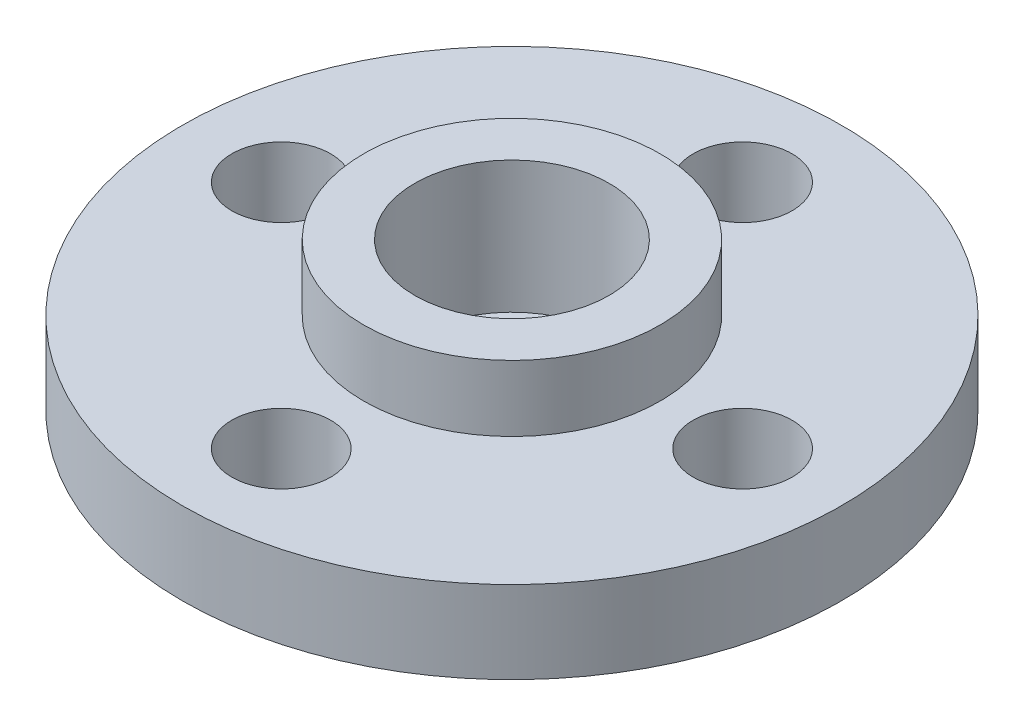
ISO-10303-21;
HEADER;
FILE_DESCRIPTION(('STEP AP214'),'2;1');
FILE_NAME('part.step','',(''),(''),'','','');
FILE_SCHEMA(('AUTOMOTIVE_DESIGN { 1 0 10303 214 1 1 1 1 }'));
ENDSEC;
DATA;
#1=APPLICATION_CONTEXT('core data for automotive mechanical design processes');
#2=APPLICATION_PROTOCOL_DEFINITION('international standard','automotive_design',2000,#1);
#3=PRODUCT_CONTEXT('',#1,'mechanical');
#4=PRODUCT('Part','Part','',(#3));
#5=PRODUCT_RELATED_PRODUCT_CATEGORY('part','',(#4));
#6=PRODUCT_DEFINITION_FORMATION('','',#4);
#7=PRODUCT_DEFINITION_CONTEXT('part definition',#1,'design');
#8=PRODUCT_DEFINITION('design','',#6,#7);
#9=PRODUCT_DEFINITION_SHAPE('','',#8);
#10=(LENGTH_UNIT() NAMED_UNIT(*) SI_UNIT(.MILLI.,.METRE.));
#11=(NAMED_UNIT(*) PLANE_ANGLE_UNIT() SI_UNIT($,.RADIAN.));
#12=(NAMED_UNIT(*) SI_UNIT($,.STERADIAN.) SOLID_ANGLE_UNIT());
#13=UNCERTAINTY_MEASURE_WITH_UNIT(LENGTH_MEASURE(1.E-05),#10,'distance_accuracy_value','');
#14=(GEOMETRIC_REPRESENTATION_CONTEXT(3) GLOBAL_UNCERTAINTY_ASSIGNED_CONTEXT((#13)) GLOBAL_UNIT_ASSIGNED_CONTEXT((#10,
#11,#12)) REPRESENTATION_CONTEXT('',''));
#15=CARTESIAN_POINT('',(0.,0.,0.));
#16=DIRECTION('',(0.,0.,1.));
#17=DIRECTION('',(1.,0.,0.));
#18=AXIS2_PLACEMENT_3D('',#15,#16,#17);
#19=CARTESIAN_POINT('',(0.,0.,0.));
#20=DIRECTION('',(0.,1.,0.));
#21=DIRECTION('',(0.,0.,1.));
#22=AXIS2_PLACEMENT_3D('',#19,#20,#21);
#23=CYLINDRICAL_SURFACE('',#22,1.6);
#24=CARTESIAN_POINT('',(0.,0.,0.));
#25=DIRECTION('',(0.,1.,0.));
#26=DIRECTION('',(0.,0.,1.));
#27=AXIS2_PLACEMENT_3D('',#24,#25,#26);
#28=CIRCLE('',#27,1.6);
#29=CARTESIAN_POINT('',(0.,0.,1.6));
#30=VERTEX_POINT('',#29);
#31=EDGE_CURVE('E86',#30,#30,#28,.T.);
#32=ORIENTED_EDGE('',*,*,#31,.F.);
#33=EDGE_LOOP('',(#32));
#34=FACE_BOUND('',#33,.T.);
#35=CARTESIAN_POINT('',(0.,0.5,0.));
#36=DIRECTION('',(0.,1.,0.));
#37=DIRECTION('',(0.,0.,1.));
#38=AXIS2_PLACEMENT_3D('',#35,#36,#37);
#39=CIRCLE('',#38,1.6);
#40=CARTESIAN_POINT('',(0.,0.5,1.6));
#41=VERTEX_POINT('',#40);
#42=EDGE_CURVE('E92',#41,#41,#39,.T.);
#43=ORIENTED_EDGE('',*,*,#42,.T.);
#44=EDGE_LOOP('',(#43));
#45=FACE_BOUND('',#44,.T.);
#46=ADVANCED_FACE('F41',(#34,#45),#23,.F.);
#47=CARTESIAN_POINT('',(0.,2.5,0.));
#48=DIRECTION('',(0.,1.,0.));
#49=DIRECTION('',(0.,0.,1.));
#50=AXIS2_PLACEMENT_3D('',#47,#48,#49);
#51=PLANE('',#50);
#52=CARTESIAN_POINT('',(0.,2.5,0.));
#53=DIRECTION('',(0.,1.,0.));
#54=DIRECTION('',(0.,0.,1.));
#55=AXIS2_PLACEMENT_3D('',#52,#53,#54);
#56=CIRCLE('',#55,4.5);
#57=CARTESIAN_POINT('',(0.,2.5,4.5));
#58=VERTEX_POINT('',#57);
#59=EDGE_CURVE('E78',#58,#58,#56,.T.);
#60=ORIENTED_EDGE('',*,*,#59,.F.);
#61=EDGE_LOOP('',(#60));
#62=FACE_BOUND('',#61,.T.);
#63=CARTESIAN_POINT('',(1.96380207734619E-13,2.5,7.));
#64=DIRECTION('',(0.,1.,0.));
#65=DIRECTION('',(0.,0.,1.));
#66=AXIS2_PLACEMENT_3D('',#63,#64,#65);
#67=CIRCLE('',#66,1.50000000000023);
#68=CARTESIAN_POINT('',(1.96380207734619E-13,2.5,8.50000000000023));
#69=VERTEX_POINT('',#68);
#70=EDGE_CURVE('E63',#69,#69,#67,.T.);
#71=ORIENTED_EDGE('',*,*,#70,.F.);
#72=EDGE_LOOP('',(#71));
#73=FACE_BOUND('',#72,.T.);
#74=CARTESIAN_POINT('',(0.,2.5,-7.));
#75=DIRECTION('',(0.,1.,0.));
#76=DIRECTION('',(0.,0.,1.));
#77=AXIS2_PLACEMENT_3D('',#74,#75,#76);
#78=CIRCLE('',#77,1.5);
#79=CARTESIAN_POINT('',(0.,2.5,-5.5));
#80=VERTEX_POINT('',#79);
#81=EDGE_CURVE('E52',#80,#80,#78,.T.);
#82=ORIENTED_EDGE('',*,*,#81,.F.);
#83=EDGE_LOOP('',(#82));
#84=FACE_BOUND('',#83,.T.);
#85=CARTESIAN_POINT('',(0.,2.5,0.));
#86=DIRECTION('',(0.,1.,0.));
#87=DIRECTION('',(0.,0.,1.));
#88=AXIS2_PLACEMENT_3D('',#85,#86,#87);
#89=CIRCLE('',#88,10.);
#90=CARTESIAN_POINT('',(0.,2.5,10.));
#91=VERTEX_POINT('',#90);
#92=EDGE_CURVE('E10',#91,#91,#89,.T.);
#93=ORIENTED_EDGE('',*,*,#92,.T.);
#94=EDGE_LOOP('',(#93));
#95=FACE_BOUND('',#94,.T.);
#96=CARTESIAN_POINT('',(7.,2.5,0.));
#97=DIRECTION('',(0.,1.,0.));
#98=DIRECTION('',(0.,0.,1.));
#99=AXIS2_PLACEMENT_3D('',#96,#97,#98);
#100=CIRCLE('',#99,1.5);
#101=CARTESIAN_POINT('',(7.,2.5,1.50000000000002));
#102=VERTEX_POINT('',#101);
#103=EDGE_CURVE('E57',#102,#102,#100,.T.);
#104=ORIENTED_EDGE('',*,*,#103,.F.);
#105=EDGE_LOOP('',(#104));
#106=FACE_BOUND('',#105,.T.);
#107=CARTESIAN_POINT('',(-7.,2.5,0.));
#108=DIRECTION('',(0.,1.,0.));
#109=DIRECTION('',(0.,0.,1.));
#110=AXIS2_PLACEMENT_3D('',#107,#108,#109);
#111=CIRCLE('',#110,1.5);
#112=CARTESIAN_POINT('',(-7.,2.5,1.49999999999993));
#113=VERTEX_POINT('',#112);
#114=EDGE_CURVE('E69',#113,#113,#111,.T.);
#115=ORIENTED_EDGE('',*,*,#114,.F.);
#116=EDGE_LOOP('',(#115));
#117=FACE_BOUND('',#116,.T.);
#118=ADVANCED_FACE('F117',(#62,#73,#84,#95,#106,#117),#51,.T.);
#119=CARTESIAN_POINT('',(0.,0.,0.));
#120=DIRECTION('',(0.,1.,0.));
#121=DIRECTION('',(0.,0.,1.));
#122=AXIS2_PLACEMENT_3D('',#119,#120,#121);
#123=PLANE('',#122);
#124=ORIENTED_EDGE('',*,*,#31,.T.);
#125=EDGE_LOOP('',(#124));
#126=FACE_BOUND('',#125,.T.);
#127=CARTESIAN_POINT('',(0.,0.,0.));
#128=DIRECTION('',(0.,1.,0.));
#129=DIRECTION('',(0.,0.,1.));
#130=AXIS2_PLACEMENT_3D('',#127,#128,#129);
#131=CIRCLE('',#130,10.);
#132=CARTESIAN_POINT('',(0.,0.,10.));
#133=VERTEX_POINT('',#132);
#134=EDGE_CURVE('E45',#133,#133,#131,.T.);
#135=ORIENTED_EDGE('',*,*,#134,.F.);
#136=EDGE_LOOP('',(#135));
#137=FACE_BOUND('',#136,.T.);
#138=CARTESIAN_POINT('',(0.,0.,-7.));
#139=DIRECTION('',(0.,1.,0.));
#140=DIRECTION('',(0.,0.,1.));
#141=AXIS2_PLACEMENT_3D('',#138,#139,#140);
#142=CIRCLE('',#141,1.5);
#143=CARTESIAN_POINT('',(0.,0.,-5.5));
#144=VERTEX_POINT('',#143);
#145=EDGE_CURVE('E54',#144,#144,#142,.T.);
#146=ORIENTED_EDGE('',*,*,#145,.T.);
#147=EDGE_LOOP('',(#146));
#148=FACE_BOUND('',#147,.T.);
#149=CARTESIAN_POINT('',(7.,0.,0.));
#150=DIRECTION('',(0.,1.,0.));
#151=DIRECTION('',(0.,0.,1.));
#152=AXIS2_PLACEMENT_3D('',#149,#150,#151);
#153=CIRCLE('',#152,1.5);
#154=CARTESIAN_POINT('',(7.,0.,1.50000000000002));
#155=VERTEX_POINT('',#154);
#156=EDGE_CURVE('E60',#155,#155,#153,.T.);
#157=ORIENTED_EDGE('',*,*,#156,.T.);
#158=EDGE_LOOP('',(#157));
#159=FACE_BOUND('',#158,.T.);
#160=CARTESIAN_POINT('',(1.96380207734619E-13,0.,7.));
#161=DIRECTION('',(0.,1.,0.));
#162=DIRECTION('',(0.,0.,1.));
#163=AXIS2_PLACEMENT_3D('',#160,#161,#162);
#164=CIRCLE('',#163,1.50000000000023);
#165=CARTESIAN_POINT('',(1.96380207734619E-13,0.,8.50000000000023));
#166=VERTEX_POINT('',#165);
#167=EDGE_CURVE('E66',#166,#166,#164,.T.);
#168=ORIENTED_EDGE('',*,*,#167,.T.);
#169=EDGE_LOOP('',(#168));
#170=FACE_BOUND('',#169,.T.);
#171=CARTESIAN_POINT('',(-7.,0.,0.));
#172=DIRECTION('',(0.,1.,0.));
#173=DIRECTION('',(0.,0.,1.));
#174=AXIS2_PLACEMENT_3D('',#171,#172,#173);
#175=CIRCLE('',#174,1.5);
#176=CARTESIAN_POINT('',(-7.,0.,1.49999999999993));
#177=VERTEX_POINT('',#176);
#178=EDGE_CURVE('E72',#177,#177,#175,.T.);
#179=ORIENTED_EDGE('',*,*,#178,.T.);
#180=EDGE_LOOP('',(#179));
#181=FACE_BOUND('',#180,.T.);
#182=ADVANCED_FACE('F122',(#126,#137,#148,#159,#170,#181),#123,.F.);
#183=CARTESIAN_POINT('',(0.,2.5,0.));
#184=DIRECTION('',(0.,-1.,0.));
#185=DIRECTION('',(0.,0.,-1.));
#186=AXIS2_PLACEMENT_3D('',#183,#184,#185);
#187=CYLINDRICAL_SURFACE('',#186,10.);
#188=ORIENTED_EDGE('',*,*,#92,.F.);
#189=EDGE_LOOP('',(#188));
#190=FACE_BOUND('',#189,.T.);
#191=ORIENTED_EDGE('',*,*,#134,.T.);
#192=EDGE_LOOP('',(#191));
#193=FACE_BOUND('',#192,.T.);
#194=ADVANCED_FACE('F43',(#190,#193),#187,.T.);
#195=CARTESIAN_POINT('',(0.,2.5,-7.));
#196=DIRECTION('',(0.,-1.,0.));
#197=DIRECTION('',(0.,0.,-1.));
#198=AXIS2_PLACEMENT_3D('',#195,#196,#197);
#199=CYLINDRICAL_SURFACE('',#198,1.5);
#200=ORIENTED_EDGE('',*,*,#81,.T.);
#201=EDGE_LOOP('',(#200));
#202=FACE_BOUND('',#201,.T.);
#203=ORIENTED_EDGE('',*,*,#145,.F.);
#204=EDGE_LOOP('',(#203));
#205=FACE_BOUND('',#204,.T.);
#206=ADVANCED_FACE('F155',(#202,#205),#199,.F.);
#207=CARTESIAN_POINT('',(7.,2.5,0.));
#208=DIRECTION('',(0.,-1.,0.));
#209=DIRECTION('',(0.,0.,-1.));
#210=AXIS2_PLACEMENT_3D('',#207,#208,#209);
#211=CYLINDRICAL_SURFACE('',#210,1.5);
#212=ORIENTED_EDGE('',*,*,#103,.T.);
#213=EDGE_LOOP('',(#212));
#214=FACE_BOUND('',#213,.T.);
#215=ORIENTED_EDGE('',*,*,#156,.F.);
#216=EDGE_LOOP('',(#215));
#217=FACE_BOUND('',#216,.T.);
#218=ADVANCED_FACE('F149',(#214,#217),#211,.F.);
#219=CARTESIAN_POINT('',(1.96380207734619E-13,2.5,7.));
#220=DIRECTION('',(0.,-1.,0.));
#221=DIRECTION('',(0.,0.,-1.));
#222=AXIS2_PLACEMENT_3D('',#219,#220,#221);
#223=CYLINDRICAL_SURFACE('',#222,1.50000000000023);
#224=ORIENTED_EDGE('',*,*,#70,.T.);
#225=EDGE_LOOP('',(#224));
#226=FACE_BOUND('',#225,.T.);
#227=ORIENTED_EDGE('',*,*,#167,.F.);
#228=EDGE_LOOP('',(#227));
#229=FACE_BOUND('',#228,.T.);
#230=ADVANCED_FACE('F141',(#226,#229),#223,.F.);
#231=CARTESIAN_POINT('',(-7.,2.5,0.));
#232=DIRECTION('',(0.,-1.,0.));
#233=DIRECTION('',(0.,0.,-1.));
#234=AXIS2_PLACEMENT_3D('',#231,#232,#233);
#235=CYLINDRICAL_SURFACE('',#234,1.5);
#236=ORIENTED_EDGE('',*,*,#114,.T.);
#237=EDGE_LOOP('',(#236));
#238=FACE_BOUND('',#237,.T.);
#239=ORIENTED_EDGE('',*,*,#178,.F.);
#240=EDGE_LOOP('',(#239));
#241=FACE_BOUND('',#240,.T.);
#242=ADVANCED_FACE('F139',(#238,#241),#235,.F.);
#243=CARTESIAN_POINT('',(0.,4.5,0.));
#244=DIRECTION('',(0.,1.,0.));
#245=DIRECTION('',(0.,0.,1.));
#246=AXIS2_PLACEMENT_3D('',#243,#244,#245);
#247=PLANE('',#246);
#248=CARTESIAN_POINT('',(0.,4.5,0.));
#249=DIRECTION('',(0.,1.,0.));
#250=DIRECTION('',(0.,0.,1.));
#251=AXIS2_PLACEMENT_3D('',#248,#249,#250);
#252=CIRCLE('',#251,4.5);
#253=CARTESIAN_POINT('',(0.,4.5,4.5));
#254=VERTEX_POINT('',#253);
#255=EDGE_CURVE('E75',#254,#254,#252,.T.);
#256=ORIENTED_EDGE('',*,*,#255,.T.);
#257=EDGE_LOOP('',(#256));
#258=FACE_BOUND('',#257,.T.);
#259=CARTESIAN_POINT('',(0.,4.5,0.));
#260=DIRECTION('',(0.,1.,0.));
#261=DIRECTION('',(0.,0.,1.));
#262=AXIS2_PLACEMENT_3D('',#259,#260,#261);
#263=CIRCLE('',#262,2.95);
#264=CARTESIAN_POINT('',(0.,4.5,2.95));
#265=VERTEX_POINT('',#264);
#266=EDGE_CURVE('E81',#265,#265,#263,.T.);
#267=ORIENTED_EDGE('',*,*,#266,.F.);
#268=EDGE_LOOP('',(#267));
#269=FACE_BOUND('',#268,.T.);
#270=ADVANCED_FACE('F111',(#258,#269),#247,.T.);
#271=CARTESIAN_POINT('',(0.,4.5,0.));
#272=DIRECTION('',(0.,-1.,0.));
#273=DIRECTION('',(0.,0.,-1.));
#274=AXIS2_PLACEMENT_3D('',#271,#272,#273);
#275=CYLINDRICAL_SURFACE('',#274,4.5);
#276=ORIENTED_EDGE('',*,*,#255,.F.);
#277=EDGE_LOOP('',(#276));
#278=FACE_BOUND('',#277,.T.);
#279=ORIENTED_EDGE('',*,*,#59,.T.);
#280=EDGE_LOOP('',(#279));
#281=FACE_BOUND('',#280,.T.);
#282=ADVANCED_FACE('F105',(#278,#281),#275,.T.);
#283=CARTESIAN_POINT('',(0.,4.5,0.));
#284=DIRECTION('',(0.,-1.,0.));
#285=DIRECTION('',(0.,0.,-1.));
#286=AXIS2_PLACEMENT_3D('',#283,#284,#285);
#287=CYLINDRICAL_SURFACE('',#286,2.95);
#288=ORIENTED_EDGE('',*,*,#266,.T.);
#289=EDGE_LOOP('',(#288));
#290=FACE_BOUND('',#289,.T.);
#291=CARTESIAN_POINT('',(0.,0.5,0.));
#292=DIRECTION('',(0.,1.,0.));
#293=DIRECTION('',(0.,0.,1.));
#294=AXIS2_PLACEMENT_3D('',#291,#292,#293);
#295=CIRCLE('',#294,2.95);
#296=CARTESIAN_POINT('',(0.,0.5,2.95));
#297=VERTEX_POINT('',#296);
#298=EDGE_CURVE('E89',#297,#297,#295,.T.);
#299=ORIENTED_EDGE('',*,*,#298,.F.);
#300=EDGE_LOOP('',(#299));
#301=FACE_BOUND('',#300,.T.);
#302=ADVANCED_FACE('F100',(#290,#301),#287,.F.);
#303=CARTESIAN_POINT('',(0.,0.5,0.));
#304=DIRECTION('',(0.,1.,0.));
#305=DIRECTION('',(0.,0.,1.));
#306=AXIS2_PLACEMENT_3D('',#303,#304,#305);
#307=PLANE('',#306);
#308=ORIENTED_EDGE('',*,*,#42,.F.);
#309=EDGE_LOOP('',(#308));
#310=FACE_BOUND('',#309,.T.);
#311=ORIENTED_EDGE('',*,*,#298,.T.);
#312=EDGE_LOOP('',(#311));
#313=FACE_BOUND('',#312,.T.);
#314=ADVANCED_FACE('F97',(#310,#313),#307,.T.);
#315=CLOSED_SHELL('',(#46,#118,#182,#194,#206,#218,#230,#242,#270,#282,#302,#314));
#316=MANIFOLD_SOLID_BREP('B2',#315);
#317=ADVANCED_BREP_SHAPE_REPRESENTATION('',(#18,#316),#14);
#318=SHAPE_DEFINITION_REPRESENTATION(#9,#317);
ENDSEC;
END-ISO-10303-21;
